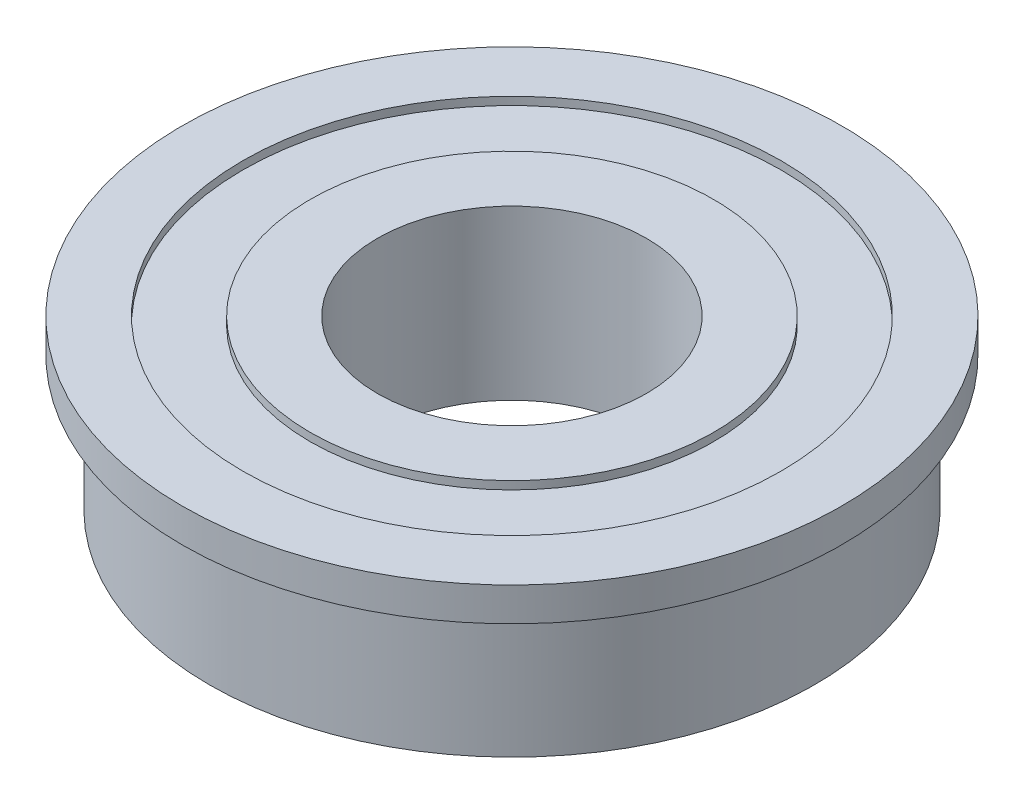
ISO-10303-21;
HEADER;
FILE_DESCRIPTION(('STEP AP214'),'2;1');
FILE_NAME('part.step','',(''),(''),'','','');
FILE_SCHEMA(('AUTOMOTIVE_DESIGN { 1 0 10303 214 1 1 1 1 }'));
ENDSEC;
DATA;
#1=APPLICATION_CONTEXT('core data for automotive mechanical design processes');
#2=APPLICATION_PROTOCOL_DEFINITION('international standard','automotive_design',2000,#1);
#3=PRODUCT_CONTEXT('',#1,'mechanical');
#4=PRODUCT('Part','Part','',(#3));
#5=PRODUCT_RELATED_PRODUCT_CATEGORY('part','',(#4));
#6=PRODUCT_DEFINITION_FORMATION('','',#4);
#7=PRODUCT_DEFINITION_CONTEXT('part definition',#1,'design');
#8=PRODUCT_DEFINITION('design','',#6,#7);
#9=PRODUCT_DEFINITION_SHAPE('','',#8);
#10=(LENGTH_UNIT() NAMED_UNIT(*) SI_UNIT(.MILLI.,.METRE.));
#11=(NAMED_UNIT(*) PLANE_ANGLE_UNIT() SI_UNIT($,.RADIAN.));
#12=(NAMED_UNIT(*) SI_UNIT($,.STERADIAN.) SOLID_ANGLE_UNIT());
#13=UNCERTAINTY_MEASURE_WITH_UNIT(LENGTH_MEASURE(1.E-05),#10,'distance_accuracy_value','');
#14=(GEOMETRIC_REPRESENTATION_CONTEXT(3) GLOBAL_UNCERTAINTY_ASSIGNED_CONTEXT((#13)) GLOBAL_UNIT_ASSIGNED_CONTEXT((#10,
#11,#12)) REPRESENTATION_CONTEXT('',''));
#15=CARTESIAN_POINT('',(0.,0.,0.));
#16=DIRECTION('',(0.,0.,1.));
#17=DIRECTION('',(1.,0.,0.));
#18=AXIS2_PLACEMENT_3D('',#15,#16,#17);
#19=CARTESIAN_POINT('',(0.,0.,0.));
#20=DIRECTION('',(0.,1.,0.));
#21=DIRECTION('',(0.,0.,1.));
#22=AXIS2_PLACEMENT_3D('',#19,#20,#21);
#23=CYLINDRICAL_SURFACE('',#22,12.7);
#24=CARTESIAN_POINT('',(0.,7.9375,0.));
#25=DIRECTION('',(0.,1.,0.));
#26=DIRECTION('',(0.,0.,1.));
#27=AXIS2_PLACEMENT_3D('',#24,#25,#26);
#28=CIRCLE('',#27,12.7);
#29=CARTESIAN_POINT('',(0.,7.9375,12.7));
#30=VERTEX_POINT('',#29);
#31=EDGE_CURVE('E45',#30,#30,#28,.F.);
#32=ORIENTED_EDGE('',*,*,#31,.F.);
#33=EDGE_LOOP('',(#32));
#34=FACE_BOUND('',#33,.T.);
#35=CARTESIAN_POINT('',(0.,7.5565,0.));
#36=DIRECTION('',(0.,1.,0.));
#37=DIRECTION('',(0.,0.,1.));
#38=AXIS2_PLACEMENT_3D('',#35,#36,#37);
#39=CIRCLE('',#38,12.7);
#40=CARTESIAN_POINT('',(0.,7.5565,12.7));
#41=VERTEX_POINT('',#40);
#42=EDGE_CURVE('E17',#41,#41,#39,.T.);
#43=ORIENTED_EDGE('',*,*,#42,.F.);
#44=EDGE_LOOP('',(#43));
#45=FACE_BOUND('',#44,.T.);
#46=ADVANCED_FACE('F14',(#34,#45),#23,.F.);
#47=CARTESIAN_POINT('',(9.525,7.5565,0.));
#48=DIRECTION('',(0.,1.,0.));
#49=DIRECTION('',(0.,0.,1.));
#50=AXIS2_PLACEMENT_3D('',#47,#48,#49);
#51=PLANE('',#50);
#52=CARTESIAN_POINT('',(0.,7.5565,0.));
#53=DIRECTION('',(0.,1.,0.));
#54=DIRECTION('',(0.,0.,1.));
#55=AXIS2_PLACEMENT_3D('',#52,#53,#54);
#56=CIRCLE('',#55,9.525);
#57=CARTESIAN_POINT('',(0.,7.5565,9.525));
#58=VERTEX_POINT('',#57);
#59=EDGE_CURVE('E43',#58,#58,#56,.T.);
#60=ORIENTED_EDGE('',*,*,#59,.F.);
#61=EDGE_LOOP('',(#60));
#62=FACE_BOUND('',#61,.T.);
#63=ORIENTED_EDGE('',*,*,#42,.T.);
#64=EDGE_LOOP('',(#63));
#65=FACE_BOUND('',#64,.T.);
#66=ADVANCED_FACE('F52',(#62,#65),#51,.T.);
#67=CARTESIAN_POINT('',(12.7,7.9375,0.));
#68=DIRECTION('',(0.,1.,0.));
#69=DIRECTION('',(0.,0.,1.));
#70=AXIS2_PLACEMENT_3D('',#67,#68,#69);
#71=PLANE('',#70);
#72=ORIENTED_EDGE('',*,*,#31,.T.);
#73=EDGE_LOOP('',(#72));
#74=FACE_BOUND('',#73,.T.);
#75=CARTESIAN_POINT('',(0.,7.9375,0.));
#76=DIRECTION('',(0.,1.,0.));
#77=DIRECTION('',(0.,0.,1.));
#78=AXIS2_PLACEMENT_3D('',#75,#76,#77);
#79=CIRCLE('',#78,15.5575);
#80=CARTESIAN_POINT('',(0.,7.9375,15.5575));
#81=VERTEX_POINT('',#80);
#82=EDGE_CURVE('E40',#81,#81,#79,.F.);
#83=ORIENTED_EDGE('',*,*,#82,.F.);
#84=EDGE_LOOP('',(#83));
#85=FACE_BOUND('',#84,.T.);
#86=ADVANCED_FACE('F60',(#74,#85),#71,.T.);
#87=CARTESIAN_POINT('',(0.,0.,0.));
#88=DIRECTION('',(0.,1.,0.));
#89=DIRECTION('',(0.,0.,1.));
#90=AXIS2_PLACEMENT_3D('',#87,#88,#89);
#91=CYLINDRICAL_SURFACE('',#90,9.525);
#92=ORIENTED_EDGE('',*,*,#59,.T.);
#93=EDGE_LOOP('',(#92));
#94=FACE_BOUND('',#93,.T.);
#95=CARTESIAN_POINT('',(0.,7.9375,0.));
#96=DIRECTION('',(0.,1.,0.));
#97=DIRECTION('',(0.,0.,1.));
#98=AXIS2_PLACEMENT_3D('',#95,#96,#97);
#99=CIRCLE('',#98,9.525);
#100=CARTESIAN_POINT('',(0.,7.9375,9.525));
#101=VERTEX_POINT('',#100);
#102=EDGE_CURVE('E37',#101,#101,#99,.T.);
#103=ORIENTED_EDGE('',*,*,#102,.F.);
#104=EDGE_LOOP('',(#103));
#105=FACE_BOUND('',#104,.T.);
#106=ADVANCED_FACE('F89',(#94,#105),#91,.T.);
#107=CARTESIAN_POINT('',(0.,0.,0.));
#108=DIRECTION('',(0.,1.,0.));
#109=DIRECTION('',(0.,0.,1.));
#110=AXIS2_PLACEMENT_3D('',#107,#108,#109);
#111=CYLINDRICAL_SURFACE('',#110,15.5575);
#112=CARTESIAN_POINT('',(0.,6.35,0.));
#113=DIRECTION('',(0.,1.,0.));
#114=DIRECTION('',(0.,0.,1.));
#115=AXIS2_PLACEMENT_3D('',#112,#113,#114);
#116=CIRCLE('',#115,15.5575);
#117=CARTESIAN_POINT('',(0.,6.35,15.5575));
#118=VERTEX_POINT('',#117);
#119=EDGE_CURVE('E34',#118,#118,#116,.F.);
#120=ORIENTED_EDGE('',*,*,#119,.F.);
#121=EDGE_LOOP('',(#120));
#122=FACE_BOUND('',#121,.T.);
#123=ORIENTED_EDGE('',*,*,#82,.T.);
#124=EDGE_LOOP('',(#123));
#125=FACE_BOUND('',#124,.T.);
#126=ADVANCED_FACE('F85',(#122,#125),#111,.T.);
#127=CARTESIAN_POINT('',(6.35,7.9375,0.));
#128=DIRECTION('',(0.,1.,0.));
#129=DIRECTION('',(0.,0.,1.));
#130=AXIS2_PLACEMENT_3D('',#127,#128,#129);
#131=PLANE('',#130);
#132=CARTESIAN_POINT('',(0.,7.9375,0.));
#133=DIRECTION('',(0.,1.,0.));
#134=DIRECTION('',(0.,0.,1.));
#135=AXIS2_PLACEMENT_3D('',#132,#133,#134);
#136=CIRCLE('',#135,6.35);
#137=CARTESIAN_POINT('',(0.,7.9375,6.35));
#138=VERTEX_POINT('',#137);
#139=EDGE_CURVE('E31',#138,#138,#136,.F.);
#140=ORIENTED_EDGE('',*,*,#139,.T.);
#141=EDGE_LOOP('',(#140));
#142=FACE_BOUND('',#141,.T.);
#143=ORIENTED_EDGE('',*,*,#102,.T.);
#144=EDGE_LOOP('',(#143));
#145=FACE_BOUND('',#144,.T.);
#146=ADVANCED_FACE('F81',(#142,#145),#131,.T.);
#147=CARTESIAN_POINT('',(15.5575,6.35,0.));
#148=DIRECTION('',(0.,-1.,0.));
#149=DIRECTION('',(0.,0.,-1.));
#150=AXIS2_PLACEMENT_3D('',#147,#148,#149);
#151=PLANE('',#150);
#152=ORIENTED_EDGE('',*,*,#119,.T.);
#153=EDGE_LOOP('',(#152));
#154=FACE_BOUND('',#153,.T.);
#155=CARTESIAN_POINT('',(0.,6.35,0.));
#156=DIRECTION('',(0.,1.,0.));
#157=DIRECTION('',(0.,0.,1.));
#158=AXIS2_PLACEMENT_3D('',#155,#156,#157);
#159=CIRCLE('',#158,14.2875);
#160=CARTESIAN_POINT('',(0.,6.35,14.2875));
#161=VERTEX_POINT('',#160);
#162=EDGE_CURVE('E26',#161,#161,#159,.F.);
#163=ORIENTED_EDGE('',*,*,#162,.F.);
#164=EDGE_LOOP('',(#163));
#165=FACE_BOUND('',#164,.T.);
#166=ADVANCED_FACE('F77',(#154,#165),#151,.T.);
#167=CARTESIAN_POINT('',(0.,0.,0.));
#168=DIRECTION('',(0.,1.,0.));
#169=DIRECTION('',(0.,0.,1.));
#170=AXIS2_PLACEMENT_3D('',#167,#168,#169);
#171=CYLINDRICAL_SURFACE('',#170,6.35);
#172=ORIENTED_EDGE('',*,*,#139,.F.);
#173=EDGE_LOOP('',(#172));
#174=FACE_BOUND('',#173,.T.);
#175=CARTESIAN_POINT('',(0.,0.,0.));
#176=DIRECTION('',(0.,1.,0.));
#177=DIRECTION('',(0.,0.,1.));
#178=AXIS2_PLACEMENT_3D('',#175,#176,#177);
#179=CIRCLE('',#178,6.35);
#180=CARTESIAN_POINT('',(0.,0.,6.35));
#181=VERTEX_POINT('',#180);
#182=EDGE_CURVE('E21',#181,#181,#179,.T.);
#183=ORIENTED_EDGE('',*,*,#182,.F.);
#184=EDGE_LOOP('',(#183));
#185=FACE_BOUND('',#184,.T.);
#186=ADVANCED_FACE('F70',(#174,#185),#171,.F.);
#187=CARTESIAN_POINT('',(0.,0.,0.));
#188=DIRECTION('',(0.,1.,0.));
#189=DIRECTION('',(0.,0.,1.));
#190=AXIS2_PLACEMENT_3D('',#187,#188,#189);
#191=CYLINDRICAL_SURFACE('',#190,14.2875);
#192=CARTESIAN_POINT('',(0.,0.,0.));
#193=DIRECTION('',(0.,1.,0.));
#194=DIRECTION('',(0.,0.,1.));
#195=AXIS2_PLACEMENT_3D('',#192,#193,#194);
#196=CIRCLE('',#195,14.2875);
#197=CARTESIAN_POINT('',(0.,0.,14.2875));
#198=VERTEX_POINT('',#197);
#199=EDGE_CURVE('E10',#198,#198,#196,.F.);
#200=ORIENTED_EDGE('',*,*,#199,.F.);
#201=EDGE_LOOP('',(#200));
#202=FACE_BOUND('',#201,.T.);
#203=ORIENTED_EDGE('',*,*,#162,.T.);
#204=EDGE_LOOP('',(#203));
#205=FACE_BOUND('',#204,.T.);
#206=ADVANCED_FACE('F64',(#202,#205),#191,.T.);
#207=CARTESIAN_POINT('',(14.2875,0.,0.));
#208=DIRECTION('',(0.,-1.,0.));
#209=DIRECTION('',(0.,0.,-1.));
#210=AXIS2_PLACEMENT_3D('',#207,#208,#209);
#211=PLANE('',#210);
#212=ORIENTED_EDGE('',*,*,#199,.T.);
#213=EDGE_LOOP('',(#212));
#214=FACE_BOUND('',#213,.T.);
#215=ORIENTED_EDGE('',*,*,#182,.T.);
#216=EDGE_LOOP('',(#215));
#217=FACE_BOUND('',#216,.T.);
#218=ADVANCED_FACE('F62',(#214,#217),#211,.T.);
#219=CLOSED_SHELL('',(#46,#66,#86,#106,#126,#146,#166,#186,#206,#218));
#220=MANIFOLD_SOLID_BREP('B1',#219);
#221=ADVANCED_BREP_SHAPE_REPRESENTATION('',(#18,#220),#14);
#222=SHAPE_DEFINITION_REPRESENTATION(#9,#221);
ENDSEC;
END-ISO-10303-21;
